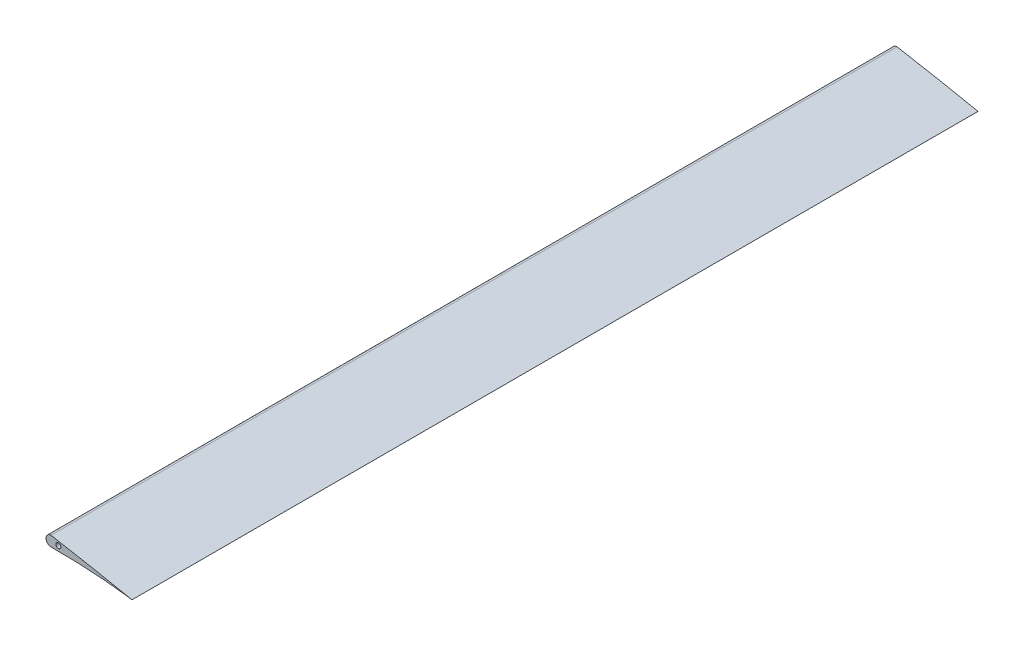
ISO-10303-21;
HEADER;
FILE_DESCRIPTION(('STEP AP214'),'2;1');
FILE_NAME('part.step','',(''),(''),'','','');
FILE_SCHEMA(('AUTOMOTIVE_DESIGN { 1 0 10303 214 1 1 1 1 }'));
ENDSEC;
DATA;
#1=APPLICATION_CONTEXT('core data for automotive mechanical design processes');
#2=APPLICATION_PROTOCOL_DEFINITION('international standard','automotive_design',2000,#1);
#3=PRODUCT_CONTEXT('',#1,'mechanical');
#4=PRODUCT('Part','Part','',(#3));
#5=PRODUCT_RELATED_PRODUCT_CATEGORY('part','',(#4));
#6=PRODUCT_DEFINITION_FORMATION('','',#4);
#7=PRODUCT_DEFINITION_CONTEXT('part definition',#1,'design');
#8=PRODUCT_DEFINITION('design','',#6,#7);
#9=PRODUCT_DEFINITION_SHAPE('','',#8);
#10=(LENGTH_UNIT() NAMED_UNIT(*) SI_UNIT(.MILLI.,.METRE.));
#11=(NAMED_UNIT(*) PLANE_ANGLE_UNIT() SI_UNIT($,.RADIAN.));
#12=(NAMED_UNIT(*) SI_UNIT($,.STERADIAN.) SOLID_ANGLE_UNIT());
#13=UNCERTAINTY_MEASURE_WITH_UNIT(LENGTH_MEASURE(1.E-05),#10,'distance_accuracy_value','');
#14=(GEOMETRIC_REPRESENTATION_CONTEXT(3) GLOBAL_UNCERTAINTY_ASSIGNED_CONTEXT((#13)) GLOBAL_UNIT_ASSIGNED_CONTEXT((#10,
#11,#12)) REPRESENTATION_CONTEXT('',''));
#15=CARTESIAN_POINT('',(0.,0.,0.));
#16=DIRECTION('',(0.,0.,1.));
#17=DIRECTION('',(1.,0.,0.));
#18=AXIS2_PLACEMENT_3D('',#15,#16,#17);
#19=CARTESIAN_POINT('',(159.442105303375,0.,345.));
#20=CARTESIAN_POINT('',(159.444041666589,0.00517293899302354,345.));
#21=CARTESIAN_POINT('',(157.98201655844,0.289124593582085,345.));
#22=CARTESIAN_POINT('',(156.492189259373,0.599756377902765,345.));
#23=CARTESIAN_POINT('',(152.859182376222,1.32074958787499,345.));
#24=CARTESIAN_POINT('',(148.403409322408,2.21330940570025,345.));
#25=CARTESIAN_POINT('',(142.595447709516,3.35652393685296,345.));
#26=CARTESIAN_POINT('',(135.778249929358,4.65486505756573,345.));
#27=CARTESIAN_POINT('',(127.978894260674,6.05225291867144,345.));
#28=CARTESIAN_POINT('',(119.360451165782,7.46436983751235,345.));
#29=CARTESIAN_POINT('',(110.059675547019,8.81023319456787,345.));
#30=CARTESIAN_POINT('',(100.238733655575,10.0214798797706,345.));
#31=CARTESIAN_POINT('',(90.0663130884757,11.0500314760708,345.));
#32=CARTESIAN_POINT('',(79.7157442411525,11.8437482984099,345.));
#33=CARTESIAN_POINT('',(69.3648812982019,12.377269962431,345.));
#34=CARTESIAN_POINT('',(60.8171055276707,12.5773739914996,345.));
#35=CARTESIAN_POINT('',(54.1137409999966,12.5701140107797,345.));
#36=CARTESIAN_POINT('',(49.2368945598231,12.4805572700286,345.));
#37=CARTESIAN_POINT('',(44.490170140264,12.3050827187702,345.));
#38=CARTESIAN_POINT('',(39.8938443605376,12.0432490256846,345.));
#39=CARTESIAN_POINT('',(35.4680620521892,11.6989104248273,345.));
#40=CARTESIAN_POINT('',(31.2317045603477,11.2760938134869,345.));
#41=CARTESIAN_POINT('',(27.2034969275112,10.7735696663569,345.));
#42=CARTESIAN_POINT('',(23.3990865922862,10.2028368508997,345.));
#43=CARTESIAN_POINT('',(19.8354928345461,9.56634551008057,345.));
#44=CARTESIAN_POINT('',(16.5285117550754,8.87283125447042,345.));
#45=CARTESIAN_POINT('',(13.4912338429526,8.13227470777814,345.));
#46=CARTESIAN_POINT('',(10.7356709603567,7.35057764516988,345.));
#47=CARTESIAN_POINT('',(8.27311761952142,6.52839452671949,345.));
#48=CARTESIAN_POINT('',(6.1111895467597,5.66561906315392,345.));
#49=CARTESIAN_POINT('',(4.26466951287558,4.7488180978913,345.));
#50=CARTESIAN_POINT('',(2.73979868397445,3.7891302636263,345.));
#51=CARTESIAN_POINT('',(1.54902058735077,2.81465331623159,345.));
#52=CARTESIAN_POINT('',(0.684336818567596,1.87818147311452,345.));
#53=CARTESIAN_POINT('',(0.147941427964357,1.03277557848856,345.));
#54=CARTESIAN_POINT('',(-0.0941046157586058,0.270575065589548,345.));
#55=CARTESIAN_POINT('',(0.103796203319057,-0.41835698644095,345.));
#56=CARTESIAN_POINT('',(0.716444961163792,-0.884546737201767,345.));
#57=CARTESIAN_POINT('',(1.59503708002856,-1.25582086540093,345.));
#58=CARTESIAN_POINT('',(2.78985636717485,-1.6280427389467,345.));
#59=CARTESIAN_POINT('',(4.30482357243303,-2.01002076489061,345.));
#60=CARTESIAN_POINT('',(6.14049427708011,-2.40133919815038,345.));
#61=CARTESIAN_POINT('',(8.29187165197266,-2.77651101747682,345.));
#62=CARTESIAN_POINT('',(10.7495256871546,-3.11464871442789,345.));
#63=CARTESIAN_POINT('',(13.5027000867326,-3.39904187493051,345.));
#64=CARTESIAN_POINT('',(16.5383756197519,-3.63598743140852,345.));
#65=CARTESIAN_POINT('',(19.8446135481378,-3.8164806695825,345.));
#66=CARTESIAN_POINT('',(23.4071297257119,-3.9483288525075,345.));
#67=CARTESIAN_POINT('',(27.2105209361198,-4.01878285870697,345.));
#68=CARTESIAN_POINT('',(31.2381418325473,-4.03169971903902,345.));
#69=CARTESIAN_POINT('',(35.473665172751,-3.974657479189,345.));
#70=CARTESIAN_POINT('',(39.8989483965157,-3.84485561940613,345.));
#71=CARTESIAN_POINT('',(44.4947812006153,-3.63806225507189,345.));
#72=CARTESIAN_POINT('',(49.2408865784819,-3.35482329339079,345.));
#73=CARTESIAN_POINT('',(54.1165691189403,-2.99712119198917,345.));
#74=CARTESIAN_POINT('',(60.8200076993617,-2.44455865668571,345.));
#75=CARTESIAN_POINT('',(69.361840873417,-1.64481580180966,345.));
#76=CARTESIAN_POINT('',(79.7056059344579,-0.639732979636057,345.));
#77=CARTESIAN_POINT('',(90.0504307547148,0.318222725986691,345.));
#78=CARTESIAN_POINT('',(100.22003246931,1.13940557345747,345.));
#79=CARTESIAN_POINT('',(110.040931435958,1.74963343348735,345.));
#80=CARTESIAN_POINT('',(119.344636344842,2.11404166822833,345.));
#81=CARTESIAN_POINT('',(127.968813776567,2.21973278801135,345.));
#82=CARTESIAN_POINT('',(135.774228034723,2.08699930592308,345.));
#83=CARTESIAN_POINT('',(142.597267000455,1.77519939613166,345.));
#84=CARTESIAN_POINT('',(148.407072645435,1.33909521882026,345.));
#85=CARTESIAN_POINT('',(152.866504997901,0.899173692169871,345.));
#86=CARTESIAN_POINT('',(156.491083641711,0.42969058659684,345.));
#87=CARTESIAN_POINT('',(157.988761141702,0.233185524527727,345.));
#88=CARTESIAN_POINT('',(159.440185317246,-0.00512918807607891,345.));
#89=CARTESIAN_POINT('',(159.442105303375,0.,345.));
#90=B_SPLINE_CURVE_WITH_KNOTS('',3,(#19,#20,#21,#22,#23,#24,#25,#26,#27,#28,#29,#30,#31,#32,#33,
#34,#35,#36,#37,#38,#39,#40,#41,#42,#43,#44,#45,#46,#47,#48,#49,#50,#51,#52,#53,#54,#55,#56,#57,
#58,#59,#60,#61,#62,#63,#64,#65,#66,#67,#68,#69,#70,#71,#72,#73,#74,#75,#76,#77,#78,#79,#80,#81,
#82,#83,#84,#85,#86,#87,#88,#89),.UNSPECIFIED.,.T.,.F.,(4,1,1,1,1,1,1,1,1,1,1,1,1,1,1,1,1,1,1,1,
1,1,1,1,1,1,1,1,1,1,1,1,1,1,1,1,1,1,1,1,1,1,1,1,1,1,1,1,1,1,1,1,1,1,1,1,1,1,1,1,1,1,1,1,1,1,1,1,
4),(0.,0.00214805430809599,0.00854975126519987,0.0190932027848274,0.0336019041127283,
0.0518116673579335,0.0734030864583847,0.0979694431410136,0.125069857849387,0.154220144730095,
0.184909693682051,0.216620255570926,0.2488107456543,0.280948926784429,0.312507484242747,
0.327906500971629,0.342968755764756,0.357635269802346,0.371852484683259,0.385561874386474,
0.398705234808855,0.411240180249529,0.423117643298698,0.434295112205051,0.444729134793795,
0.454375797563894,0.463214981564661,0.471223180029748,0.478387128907674,0.484734913353525,
0.490272764521108,0.49501957796766,0.498937389313408,0.502001720182591,0.504262280766223,
0.506099971808543,0.508217728904997,0.511109021456395,0.514949183066079,0.519768396621701,
0.525567785875162,0.532308946933197,0.539970427286293,0.548516151893645,0.557914395716619,
0.568140585296994,0.579150254833381,0.590897186744504,0.603335473672981,0.616414202216844,
0.630087791046481,0.64429599930344,0.658978179653156,0.67407735390885,0.689528146540666,
0.721210905240941,0.753454187324373,0.785684184668444,0.817334232856559,0.847849866464666,
0.876721279320122,0.90346839751331,0.927655073953592,0.948890458522587,0.966808426914461,
0.981110174299129,0.991529529203157,0.997870113187357,1.),.UNSPECIFIED.);
#91=DIRECTION('',(0.,0.,-1.));
#92=VECTOR('',#91,1.);
#93=SURFACE_OF_LINEAR_EXTRUSION('',#90,#92);
#94=DIRECTION('',(0.,0.,-1.));
#95=VECTOR('',#94,1.);
#96=CARTESIAN_POINT('',(126.442112926565,6.29230498990824,345.));
#97=LINE('',#96,#95);
#98=CARTESIAN_POINT('',(126.442112926565,6.29230498990824,345.));
#99=VERTEX_POINT('',#98);
#100=CARTESIAN_POINT('',(126.44211290711,6.29230499318607,0.));
#101=VERTEX_POINT('',#100);
#102=EDGE_CURVE('E66',#99,#101,#97,.T.);
#103=ORIENTED_EDGE('',*,*,#102,.F.);
#104=CARTESIAN_POINT('',(126.442112926565,2.17860723440547,345.));
#105=VERTEX_POINT('',#104);
#106=EDGE_CURVE('E11',#105,#99,#90,.T.);
#107=ORIENTED_EDGE('',*,*,#106,.F.);
#108=DIRECTION('',(0.,0.,-1.));
#109=VECTOR('',#108,1.);
#110=CARTESIAN_POINT('',(126.442112926565,2.17860723440547,345.));
#111=LINE('',#110,#109);
#112=CARTESIAN_POINT('',(126.442112926565,2.17860723440547,0.));
#113=VERTEX_POINT('',#112);
#114=EDGE_CURVE('E64',#113,#105,#111,.F.);
#115=ORIENTED_EDGE('',*,*,#114,.F.);
#116=CARTESIAN_POINT('',(159.442105303375,0.,0.));
#117=CARTESIAN_POINT('',(159.444041666589,0.00517293899302354,0.));
#118=CARTESIAN_POINT('',(157.98201655844,0.289124593582085,0.));
#119=CARTESIAN_POINT('',(156.492189259373,0.599756377902765,0.));
#120=CARTESIAN_POINT('',(152.859182376222,1.32074958787499,0.));
#121=CARTESIAN_POINT('',(148.403409322408,2.21330940570025,0.));
#122=CARTESIAN_POINT('',(142.595447709516,3.35652393685296,0.));
#123=CARTESIAN_POINT('',(135.778249929358,4.65486505756573,0.));
#124=CARTESIAN_POINT('',(127.978894260674,6.05225291867144,0.));
#125=CARTESIAN_POINT('',(119.360451165782,7.46436983751235,0.));
#126=CARTESIAN_POINT('',(110.059675547019,8.81023319456787,0.));
#127=CARTESIAN_POINT('',(100.238733655575,10.0214798797706,0.));
#128=CARTESIAN_POINT('',(90.0663130884757,11.0500314760708,0.));
#129=CARTESIAN_POINT('',(79.7157442411525,11.8437482984099,0.));
#130=CARTESIAN_POINT('',(69.3648812982019,12.377269962431,0.));
#131=CARTESIAN_POINT('',(60.8171055276707,12.5773739914996,0.));
#132=CARTESIAN_POINT('',(54.1137409999966,12.5701140107797,0.));
#133=CARTESIAN_POINT('',(49.2368945598231,12.4805572700286,0.));
#134=CARTESIAN_POINT('',(44.490170140264,12.3050827187702,0.));
#135=CARTESIAN_POINT('',(39.8938443605376,12.0432490256846,0.));
#136=CARTESIAN_POINT('',(35.4680620521892,11.6989104248273,0.));
#137=CARTESIAN_POINT('',(31.2317045603477,11.2760938134869,0.));
#138=CARTESIAN_POINT('',(27.2034969275112,10.7735696663569,0.));
#139=CARTESIAN_POINT('',(23.3990865922862,10.2028368508997,0.));
#140=CARTESIAN_POINT('',(19.8354928345461,9.56634551008057,0.));
#141=CARTESIAN_POINT('',(16.5285117550754,8.87283125447042,0.));
#142=CARTESIAN_POINT('',(13.4912338429526,8.13227470777814,0.));
#143=CARTESIAN_POINT('',(10.7356709603567,7.35057764516988,0.));
#144=CARTESIAN_POINT('',(8.27311761952142,6.52839452671949,0.));
#145=CARTESIAN_POINT('',(6.1111895467597,5.66561906315392,0.));
#146=CARTESIAN_POINT('',(4.26466951287558,4.7488180978913,0.));
#147=CARTESIAN_POINT('',(2.73979868397445,3.7891302636263,0.));
#148=CARTESIAN_POINT('',(1.54902058735077,2.81465331623159,0.));
#149=CARTESIAN_POINT('',(0.684336818567596,1.87818147311452,0.));
#150=CARTESIAN_POINT('',(0.147941427964357,1.03277557848856,0.));
#151=CARTESIAN_POINT('',(-0.0941046157586058,0.270575065589548,0.));
#152=CARTESIAN_POINT('',(0.103796203319057,-0.41835698644095,0.));
#153=CARTESIAN_POINT('',(0.716444961163792,-0.884546737201767,0.));
#154=CARTESIAN_POINT('',(1.59503708002856,-1.25582086540093,0.));
#155=CARTESIAN_POINT('',(2.78985636717485,-1.6280427389467,0.));
#156=CARTESIAN_POINT('',(4.30482357243303,-2.01002076489061,0.));
#157=CARTESIAN_POINT('',(6.14049427708011,-2.40133919815038,0.));
#158=CARTESIAN_POINT('',(8.29187165197266,-2.77651101747682,0.));
#159=CARTESIAN_POINT('',(10.7495256871546,-3.11464871442789,0.));
#160=CARTESIAN_POINT('',(13.5027000867326,-3.39904187493051,0.));
#161=CARTESIAN_POINT('',(16.5383756197519,-3.63598743140852,0.));
#162=CARTESIAN_POINT('',(19.8446135481378,-3.8164806695825,0.));
#163=CARTESIAN_POINT('',(23.4071297257119,-3.9483288525075,0.));
#164=CARTESIAN_POINT('',(27.2105209361198,-4.01878285870697,0.));
#165=CARTESIAN_POINT('',(31.2381418325473,-4.03169971903902,0.));
#166=CARTESIAN_POINT('',(35.473665172751,-3.974657479189,0.));
#167=CARTESIAN_POINT('',(39.8989483965157,-3.84485561940613,0.));
#168=CARTESIAN_POINT('',(44.4947812006153,-3.63806225507189,0.));
#169=CARTESIAN_POINT('',(49.2408865784819,-3.35482329339079,0.));
#170=CARTESIAN_POINT('',(54.1165691189403,-2.99712119198917,0.));
#171=CARTESIAN_POINT('',(60.8200076993617,-2.44455865668571,0.));
#172=CARTESIAN_POINT('',(69.361840873417,-1.64481580180966,0.));
#173=CARTESIAN_POINT('',(79.7056059344579,-0.639732979636057,0.));
#174=CARTESIAN_POINT('',(90.0504307547148,0.318222725986691,0.));
#175=CARTESIAN_POINT('',(100.22003246931,1.13940557345747,0.));
#176=CARTESIAN_POINT('',(110.040931435958,1.74963343348735,0.));
#177=CARTESIAN_POINT('',(119.344636344842,2.11404166822833,0.));
#178=CARTESIAN_POINT('',(127.968813776567,2.21973278801135,0.));
#179=CARTESIAN_POINT('',(135.774228034723,2.08699930592308,0.));
#180=CARTESIAN_POINT('',(142.597267000455,1.77519939613166,0.));
#181=CARTESIAN_POINT('',(148.407072645435,1.33909521882026,0.));
#182=CARTESIAN_POINT('',(152.866504997901,0.899173692169871,0.));
#183=CARTESIAN_POINT('',(156.491083641711,0.42969058659684,0.));
#184=CARTESIAN_POINT('',(157.988761141702,0.233185524527727,0.));
#185=CARTESIAN_POINT('',(159.440185317246,-0.00512918807607891,0.));
#186=CARTESIAN_POINT('',(159.442105303375,0.,0.));
#187=B_SPLINE_CURVE_WITH_KNOTS('',3,(#116,#117,#118,#119,#120,#121,#122,#123,#124,#125,#126,
#127,#128,#129,#130,#131,#132,#133,#134,#135,#136,#137,#138,#139,#140,#141,#142,#143,#144,#145,
#146,#147,#148,#149,#150,#151,#152,#153,#154,#155,#156,#157,#158,#159,#160,#161,#162,#163,#164,
#165,#166,#167,#168,#169,#170,#171,#172,#173,#174,#175,#176,#177,#178,#179,#180,#181,#182,#183,
#184,#185,#186),.UNSPECIFIED.,.T.,.F.,(4,1,1,1,1,1,1,1,1,1,1,1,1,1,1,1,1,1,1,1,1,1,1,1,1,1,1,1,
1,1,1,1,1,1,1,1,1,1,1,1,1,1,1,1,1,1,1,1,1,1,1,1,1,1,1,1,1,1,1,1,1,1,1,1,1,1,1,1,4),(0.,
0.00214805430809599,0.00854975126519987,0.0190932027848274,0.0336019041127283,
0.0518116673579335,0.0734030864583847,0.0979694431410136,0.125069857849387,0.154220144730095,
0.184909693682051,0.216620255570926,0.2488107456543,0.280948926784429,0.312507484242747,
0.327906500971629,0.342968755764756,0.357635269802346,0.371852484683259,0.385561874386474,
0.398705234808855,0.411240180249529,0.423117643298698,0.434295112205051,0.444729134793795,
0.454375797563894,0.463214981564661,0.471223180029748,0.478387128907674,0.484734913353525,
0.490272764521108,0.49501957796766,0.498937389313408,0.502001720182591,0.504262280766223,
0.506099971808543,0.508217728904997,0.511109021456395,0.514949183066079,0.519768396621701,
0.525567785875162,0.532308946933197,0.539970427286293,0.548516151893645,0.557914395716619,
0.568140585296994,0.579150254833381,0.590897186744504,0.603335473672981,0.616414202216844,
0.630087791046481,0.64429599930344,0.658978179653156,0.67407735390885,0.689528146540666,
0.721210905240941,0.753454187324373,0.785684184668444,0.817334232856559,0.847849866464666,
0.876721279320122,0.90346839751331,0.927655073953592,0.948890458522587,0.966808426914461,
0.981110174299129,0.991529529203157,0.997870113187357,1.),.UNSPECIFIED.);
#188=EDGE_CURVE('E39',#113,#101,#187,.T.);
#189=ORIENTED_EDGE('',*,*,#188,.T.);
#190=EDGE_LOOP('',(#103,#107,#115,#189));
#191=FACE_BOUND('',#190,.T.);
#192=ADVANCED_FACE('F35',(#191),#93,.F.);
#193=CARTESIAN_POINT('',(0.457464793139424,1.50307631094347,345.));
#194=DIRECTION('',(0.,0.,-1.));
#195=DIRECTION('',(-1.,0.,0.));
#196=AXIS2_PLACEMENT_3D('',#193,#194,#195);
#197=PLANE('',#196);
#198=CARTESIAN_POINT('',(129.442112926565,4.12323432804801,345.));
#199=DIRECTION('',(0.,0.,1.));
#200=DIRECTION('',(1.,0.,0.));
#201=AXIS2_PLACEMENT_3D('',#198,#199,#200);
#202=CIRCLE('',#201,0.999999999999998);
#203=CARTESIAN_POINT('',(130.442112926565,4.12323432804801,345.));
#204=VERTEX_POINT('',#203);
#205=EDGE_CURVE('E82',#204,#204,#202,.T.);
#206=ORIENTED_EDGE('',*,*,#205,.F.);
#207=EDGE_LOOP('',(#206));
#208=FACE_BOUND('',#207,.T.);
#209=ORIENTED_EDGE('',*,*,#106,.T.);
#210=CARTESIAN_POINT('',(126.442112926565,4.23545611215686,345.));
#211=DIRECTION('',(0.,0.,1.));
#212=DIRECTION('',(-1.,0.,0.));
#213=AXIS2_PLACEMENT_3D('',#210,#211,#212);
#214=CIRCLE('',#213,2.05684887775138);
#215=EDGE_CURVE('E58',#99,#105,#214,.T.);
#216=ORIENTED_EDGE('',*,*,#215,.T.);
#217=EDGE_LOOP('',(#209,#216));
#218=FACE_BOUND('',#217,.T.);
#219=ADVANCED_FACE('F95',(#208,#218),#197,.F.);
#220=CARTESIAN_POINT('',(0.457464793139424,1.50307631094347,0.));
#221=DIRECTION('',(0.,0.,-1.));
#222=DIRECTION('',(-1.,0.,0.));
#223=AXIS2_PLACEMENT_3D('',#220,#221,#222);
#224=PLANE('',#223);
#225=CARTESIAN_POINT('',(129.442112926565,4.12323432804801,0.));
#226=DIRECTION('',(0.,0.,1.));
#227=DIRECTION('',(1.,0.,0.));
#228=AXIS2_PLACEMENT_3D('',#225,#226,#227);
#229=CIRCLE('',#228,0.999999999999998);
#230=CARTESIAN_POINT('',(130.442112926565,4.12323432804801,0.));
#231=VERTEX_POINT('',#230);
#232=EDGE_CURVE('E68',#231,#231,#229,.T.);
#233=ORIENTED_EDGE('',*,*,#232,.T.);
#234=EDGE_LOOP('',(#233));
#235=FACE_BOUND('',#234,.T.);
#236=ORIENTED_EDGE('',*,*,#188,.F.);
#237=CARTESIAN_POINT('',(126.442112926565,4.23545611215686,0.));
#238=DIRECTION('',(0.,0.,1.));
#239=DIRECTION('',(-1.,0.,0.));
#240=AXIS2_PLACEMENT_3D('',#237,#238,#239);
#241=CIRCLE('',#240,2.05684887775138);
#242=EDGE_CURVE('E50',#101,#113,#241,.T.);
#243=ORIENTED_EDGE('',*,*,#242,.F.);
#244=EDGE_LOOP('',(#236,#243));
#245=FACE_BOUND('',#244,.T.);
#246=ADVANCED_FACE('F72',(#235,#245),#224,.T.);
#247=CARTESIAN_POINT('',(126.442112926565,4.23545611215686,345.));
#248=DIRECTION('',(0.,0.,-1.));
#249=DIRECTION('',(-1.,0.,0.));
#250=AXIS2_PLACEMENT_3D('',#247,#248,#249);
#251=CYLINDRICAL_SURFACE('',#250,2.05684887775138);
#252=ORIENTED_EDGE('',*,*,#242,.T.);
#253=ORIENTED_EDGE('',*,*,#114,.T.);
#254=ORIENTED_EDGE('',*,*,#215,.F.);
#255=ORIENTED_EDGE('',*,*,#102,.T.);
#256=EDGE_LOOP('',(#252,#253,#254,#255));
#257=FACE_BOUND('',#256,.T.);
#258=ADVANCED_FACE('F63',(#257),#251,.T.);
#259=CARTESIAN_POINT('',(129.442112926565,4.12323432804801,0.));
#260=DIRECTION('',(0.,0.,1.));
#261=DIRECTION('',(1.,0.,0.));
#262=AXIS2_PLACEMENT_3D('',#259,#260,#261);
#263=CYLINDRICAL_SURFACE('',#262,0.999999999999998);
#264=ORIENTED_EDGE('',*,*,#232,.F.);
#265=EDGE_LOOP('',(#264));
#266=FACE_BOUND('',#265,.T.);
#267=ORIENTED_EDGE('',*,*,#205,.T.);
#268=EDGE_LOOP('',(#267));
#269=FACE_BOUND('',#268,.T.);
#270=ADVANCED_FACE('F89',(#266,#269),#263,.F.);
#271=CLOSED_SHELL('',(#192,#219,#246,#258,#270));
#272=MANIFOLD_SOLID_BREP('B2',#271);
#273=ADVANCED_BREP_SHAPE_REPRESENTATION('',(#18,#272),#14);
#274=SHAPE_DEFINITION_REPRESENTATION(#9,#273);
ENDSEC;
END-ISO-10303-21;
